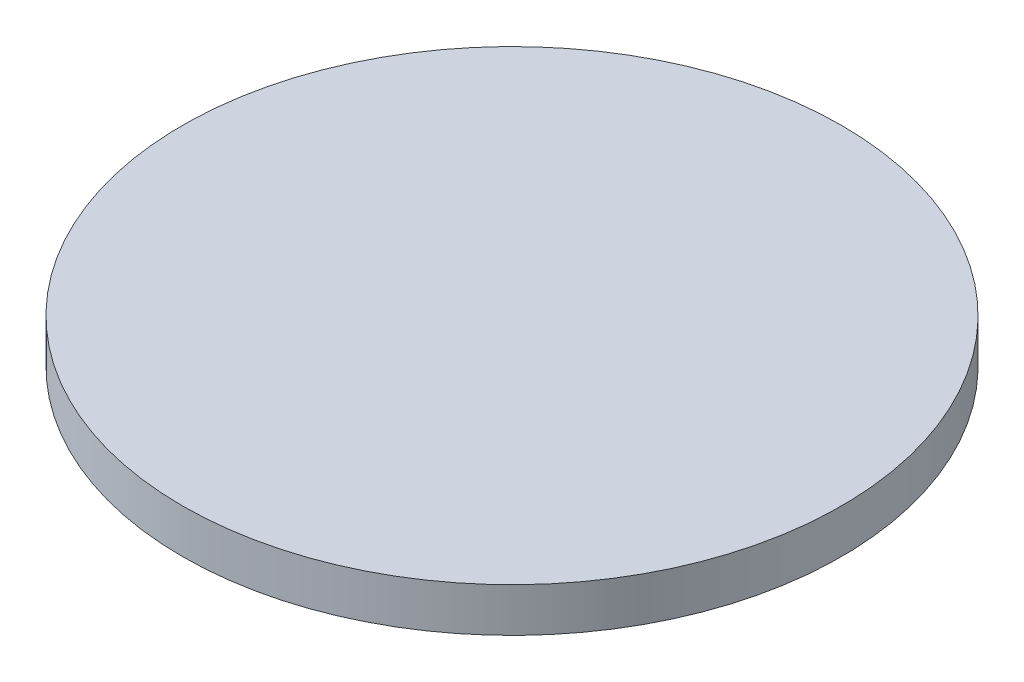
ISO-10303-21;
HEADER;
FILE_DESCRIPTION(('STEP AP214'),'2;1');
FILE_NAME('part.step','',(''),(''),'','','');
FILE_SCHEMA(('AUTOMOTIVE_DESIGN { 1 0 10303 214 1 1 1 1 }'));
ENDSEC;
DATA;
#1=APPLICATION_CONTEXT('core data for automotive mechanical design processes');
#2=APPLICATION_PROTOCOL_DEFINITION('international standard','automotive_design',2000,#1);
#3=PRODUCT_CONTEXT('',#1,'mechanical');
#4=PRODUCT('Part','Part','',(#3));
#5=PRODUCT_RELATED_PRODUCT_CATEGORY('part','',(#4));
#6=PRODUCT_DEFINITION_FORMATION('','',#4);
#7=PRODUCT_DEFINITION_CONTEXT('part definition',#1,'design');
#8=PRODUCT_DEFINITION('design','',#6,#7);
#9=PRODUCT_DEFINITION_SHAPE('','',#8);
#10=(LENGTH_UNIT() NAMED_UNIT(*) SI_UNIT(.MILLI.,.METRE.));
#11=(NAMED_UNIT(*) PLANE_ANGLE_UNIT() SI_UNIT($,.RADIAN.));
#12=(NAMED_UNIT(*) SI_UNIT($,.STERADIAN.) SOLID_ANGLE_UNIT());
#13=UNCERTAINTY_MEASURE_WITH_UNIT(LENGTH_MEASURE(1.E-05),#10,'distance_accuracy_value','');
#14=(GEOMETRIC_REPRESENTATION_CONTEXT(3) GLOBAL_UNCERTAINTY_ASSIGNED_CONTEXT((#13)) GLOBAL_UNIT_ASSIGNED_CONTEXT((#10,
#11,#12)) REPRESENTATION_CONTEXT('',''));
#15=CARTESIAN_POINT('',(0.,0.,0.));
#16=DIRECTION('',(0.,0.,1.));
#17=DIRECTION('',(1.,0.,0.));
#18=AXIS2_PLACEMENT_3D('',#15,#16,#17);
#19=CARTESIAN_POINT('',(0.,10.,0.));
#20=DIRECTION('',(0.,-1.,0.));
#21=DIRECTION('',(0.,0.,-1.));
#22=AXIS2_PLACEMENT_3D('',#19,#20,#21);
#23=CYLINDRICAL_SURFACE('',#22,75.);
#24=CARTESIAN_POINT('',(0.,10.,0.));
#25=DIRECTION('',(0.,1.,0.));
#26=DIRECTION('',(0.,0.,1.));
#27=AXIS2_PLACEMENT_3D('',#24,#25,#26);
#28=CIRCLE('',#27,75.);
#29=CARTESIAN_POINT('',(0.,10.,75.));
#30=VERTEX_POINT('',#29);
#31=EDGE_CURVE('E10',#30,#30,#28,.T.);
#32=ORIENTED_EDGE('',*,*,#31,.F.);
#33=EDGE_LOOP('',(#32));
#34=FACE_BOUND('',#33,.T.);
#35=CARTESIAN_POINT('',(0.,0.,0.));
#36=DIRECTION('',(0.,1.,0.));
#37=DIRECTION('',(0.,0.,1.));
#38=AXIS2_PLACEMENT_3D('',#35,#36,#37);
#39=CIRCLE('',#38,75.);
#40=CARTESIAN_POINT('',(0.,0.,75.));
#41=VERTEX_POINT('',#40);
#42=EDGE_CURVE('E34',#41,#41,#39,.T.);
#43=ORIENTED_EDGE('',*,*,#42,.T.);
#44=EDGE_LOOP('',(#43));
#45=FACE_BOUND('',#44,.T.);
#46=ADVANCED_FACE('F31',(#34,#45),#23,.T.);
#47=CARTESIAN_POINT('',(0.,10.,0.));
#48=DIRECTION('',(0.,1.,0.));
#49=DIRECTION('',(0.,0.,1.));
#50=AXIS2_PLACEMENT_3D('',#47,#48,#49);
#51=PLANE('',#50);
#52=ORIENTED_EDGE('',*,*,#31,.T.);
#53=EDGE_LOOP('',(#52));
#54=FACE_BOUND('',#53,.T.);
#55=ADVANCED_FACE('F46',(#54),#51,.T.);
#56=CARTESIAN_POINT('',(0.,0.,0.));
#57=DIRECTION('',(0.,1.,0.));
#58=DIRECTION('',(0.,0.,1.));
#59=AXIS2_PLACEMENT_3D('',#56,#57,#58);
#60=PLANE('',#59);
#61=ORIENTED_EDGE('',*,*,#42,.F.);
#62=EDGE_LOOP('',(#61));
#63=FACE_BOUND('',#62,.T.);
#64=ADVANCED_FACE('F44',(#63),#60,.F.);
#65=CLOSED_SHELL('',(#46,#55,#64));
#66=MANIFOLD_SOLID_BREP('B2',#65);
#67=ADVANCED_BREP_SHAPE_REPRESENTATION('',(#18,#66),#14);
#68=SHAPE_DEFINITION_REPRESENTATION(#9,#67);
ENDSEC;
END-ISO-10303-21;
